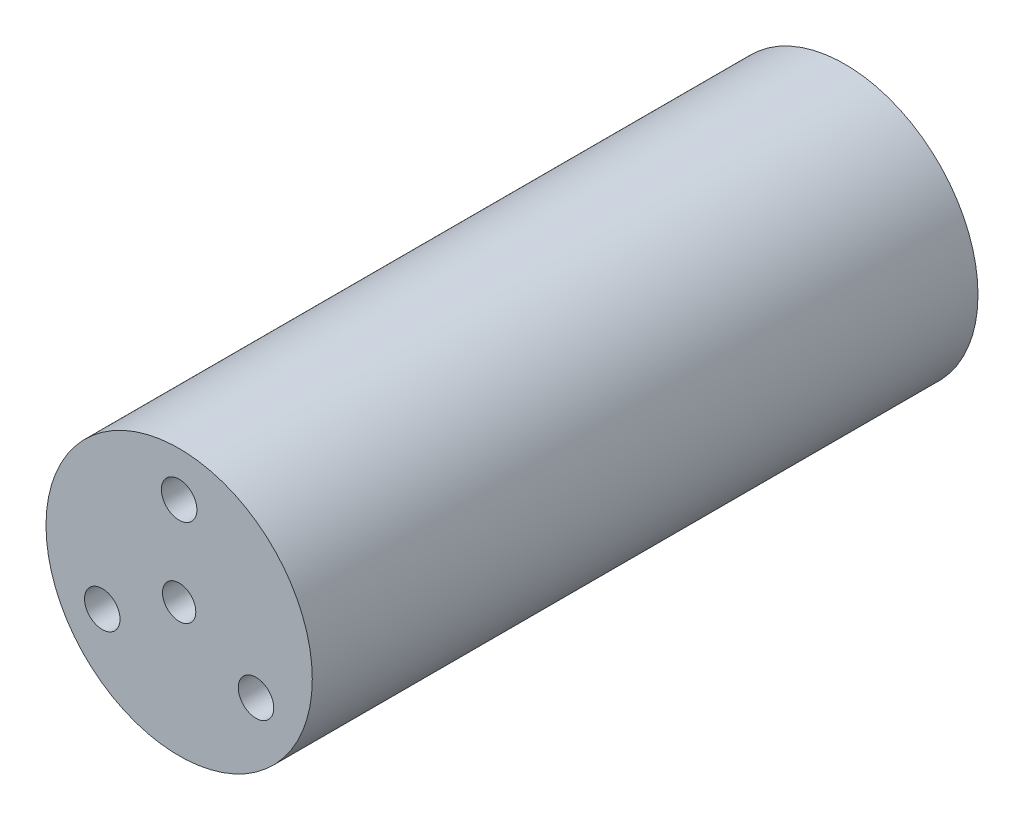
ISO-10303-21;
HEADER;
FILE_DESCRIPTION(('STEP AP214'),'2;1');
FILE_NAME('part.step','',(''),(''),'','','');
FILE_SCHEMA(('AUTOMOTIVE_DESIGN { 1 0 10303 214 1 1 1 1 }'));
ENDSEC;
DATA;
#1=APPLICATION_CONTEXT('core data for automotive mechanical design processes');
#2=APPLICATION_PROTOCOL_DEFINITION('international standard','automotive_design',2000,#1);
#3=PRODUCT_CONTEXT('',#1,'mechanical');
#4=PRODUCT('Part','Part','',(#3));
#5=PRODUCT_RELATED_PRODUCT_CATEGORY('part','',(#4));
#6=PRODUCT_DEFINITION_FORMATION('','',#4);
#7=PRODUCT_DEFINITION_CONTEXT('part definition',#1,'design');
#8=PRODUCT_DEFINITION('design','',#6,#7);
#9=PRODUCT_DEFINITION_SHAPE('','',#8);
#10=(LENGTH_UNIT() NAMED_UNIT(*) SI_UNIT(.MILLI.,.METRE.));
#11=(NAMED_UNIT(*) PLANE_ANGLE_UNIT() SI_UNIT($,.RADIAN.));
#12=(NAMED_UNIT(*) SI_UNIT($,.STERADIAN.) SOLID_ANGLE_UNIT());
#13=UNCERTAINTY_MEASURE_WITH_UNIT(LENGTH_MEASURE(1.E-05),#10,'distance_accuracy_value','');
#14=(GEOMETRIC_REPRESENTATION_CONTEXT(3) GLOBAL_UNCERTAINTY_ASSIGNED_CONTEXT((#13)) GLOBAL_UNIT_ASSIGNED_CONTEXT((#10,
#11,#12)) REPRESENTATION_CONTEXT('',''));
#15=CARTESIAN_POINT('',(0.,0.,0.));
#16=DIRECTION('',(0.,0.,1.));
#17=DIRECTION('',(1.,0.,0.));
#18=AXIS2_PLACEMENT_3D('',#15,#16,#17);
#19=CARTESIAN_POINT('',(0.,0.,30.));
#20=DIRECTION('',(0.,0.,1.));
#21=DIRECTION('',(1.,0.,0.));
#22=AXIS2_PLACEMENT_3D('',#19,#20,#21);
#23=PLANE('',#22);
#24=CARTESIAN_POINT('',(-3.46410161513777,-1.99999999999997,30.));
#25=DIRECTION('',(0.,0.,1.));
#26=DIRECTION('',(1.,0.,0.));
#27=AXIS2_PLACEMENT_3D('',#24,#25,#26);
#28=CIRCLE('',#27,0.799999999999998);
#29=CARTESIAN_POINT('',(-2.66410161513777,-1.99999999999997,30.));
#30=VERTEX_POINT('',#29);
#31=EDGE_CURVE('E62',#30,#30,#28,.T.);
#32=ORIENTED_EDGE('',*,*,#31,.F.);
#33=EDGE_LOOP('',(#32));
#34=FACE_BOUND('',#33,.T.);
#35=CARTESIAN_POINT('',(3.46410161513775,-2.00000000000002,30.));
#36=DIRECTION('',(0.,0.,1.));
#37=DIRECTION('',(1.,0.,0.));
#38=AXIS2_PLACEMENT_3D('',#35,#36,#37);
#39=CIRCLE('',#38,0.799999999999998);
#40=CARTESIAN_POINT('',(4.26410161513774,-2.00000000000002,30.));
#41=VERTEX_POINT('',#40);
#42=EDGE_CURVE('E61',#41,#41,#39,.T.);
#43=ORIENTED_EDGE('',*,*,#42,.F.);
#44=EDGE_LOOP('',(#43));
#45=FACE_BOUND('',#44,.T.);
#46=CARTESIAN_POINT('',(0.,4.,30.));
#47=DIRECTION('',(0.,0.,1.));
#48=DIRECTION('',(1.,0.,0.));
#49=AXIS2_PLACEMENT_3D('',#46,#47,#48);
#50=CIRCLE('',#49,0.799999999999998);
#51=CARTESIAN_POINT('',(0.799999999999998,4.,30.));
#52=VERTEX_POINT('',#51);
#53=EDGE_CURVE('E74',#52,#52,#50,.T.);
#54=ORIENTED_EDGE('',*,*,#53,.F.);
#55=EDGE_LOOP('',(#54));
#56=FACE_BOUND('',#55,.T.);
#57=CARTESIAN_POINT('',(0.,0.,30.));
#58=DIRECTION('',(0.,0.,1.));
#59=DIRECTION('',(1.,0.,0.));
#60=AXIS2_PLACEMENT_3D('',#57,#58,#59);
#61=CIRCLE('',#60,6.);
#62=CARTESIAN_POINT('',(6.,0.,30.));
#63=VERTEX_POINT('',#62);
#64=EDGE_CURVE('E11',#63,#63,#61,.T.);
#65=ORIENTED_EDGE('',*,*,#64,.T.);
#66=EDGE_LOOP('',(#65));
#67=FACE_BOUND('',#66,.T.);
#68=CARTESIAN_POINT('',(0.,0.,30.));
#69=DIRECTION('',(0.,0.,1.));
#70=DIRECTION('',(1.,0.,0.));
#71=AXIS2_PLACEMENT_3D('',#68,#69,#70);
#72=CIRCLE('',#71,0.75);
#73=CARTESIAN_POINT('',(0.75,0.,30.));
#74=VERTEX_POINT('',#73);
#75=EDGE_CURVE('E81',#74,#74,#72,.T.);
#76=ORIENTED_EDGE('',*,*,#75,.F.);
#77=EDGE_LOOP('',(#76));
#78=FACE_BOUND('',#77,.T.);
#79=ADVANCED_FACE('F33',(#34,#45,#56,#67,#78),#23,.T.);
#80=CARTESIAN_POINT('',(0.,0.,0.));
#81=DIRECTION('',(0.,0.,1.));
#82=DIRECTION('',(1.,0.,0.));
#83=AXIS2_PLACEMENT_3D('',#80,#81,#82);
#84=PLANE('',#83);
#85=CARTESIAN_POINT('',(-1.27553556471539,3.79117515068167,0.));
#86=DIRECTION('',(0.,0.,-1.));
#87=DIRECTION('',(1.,0.,0.));
#88=AXIS2_PLACEMENT_3D('',#85,#86,#87);
#89=CIRCLE('',#88,1.);
#90=CARTESIAN_POINT('',(-0.275535564715393,3.79117515068166,0.));
#91=VERTEX_POINT('',#90);
#92=EDGE_CURVE('E159',#91,#91,#89,.T.);
#93=ORIENTED_EDGE('',*,*,#92,.F.);
#94=EDGE_LOOP('',(#93));
#95=FACE_BOUND('',#94,.T.);
#96=CARTESIAN_POINT('',(1.27553556471542,-3.79117515068166,0.));
#97=DIRECTION('',(0.,0.,-1.));
#98=DIRECTION('',(-1.,0.,0.));
#99=AXIS2_PLACEMENT_3D('',#96,#97,#98);
#100=CIRCLE('',#99,1.);
#101=CARTESIAN_POINT('',(0.275535564715419,-3.79117515068166,0.));
#102=VERTEX_POINT('',#101);
#103=EDGE_CURVE('E158',#102,#102,#100,.T.);
#104=ORIENTED_EDGE('',*,*,#103,.F.);
#105=EDGE_LOOP('',(#104));
#106=FACE_BOUND('',#105,.T.);
#107=CARTESIAN_POINT('',(0.,0.,0.));
#108=DIRECTION('',(0.,0.,1.));
#109=DIRECTION('',(1.,0.,0.));
#110=AXIS2_PLACEMENT_3D('',#107,#108,#109);
#111=CIRCLE('',#110,6.);
#112=CARTESIAN_POINT('',(6.,0.,0.));
#113=VERTEX_POINT('',#112);
#114=EDGE_CURVE('E37',#113,#113,#111,.T.);
#115=ORIENTED_EDGE('',*,*,#114,.F.);
#116=EDGE_LOOP('',(#115));
#117=FACE_BOUND('',#116,.T.);
#118=CARTESIAN_POINT('',(0.,0.,0.));
#119=DIRECTION('',(0.,0.,1.));
#120=DIRECTION('',(1.,0.,0.));
#121=AXIS2_PLACEMENT_3D('',#118,#119,#120);
#122=CIRCLE('',#121,0.75);
#123=CARTESIAN_POINT('',(0.75,0.,0.));
#124=VERTEX_POINT('',#123);
#125=EDGE_CURVE('E80',#124,#124,#122,.T.);
#126=ORIENTED_EDGE('',*,*,#125,.T.);
#127=EDGE_LOOP('',(#126));
#128=FACE_BOUND('',#127,.T.);
#129=ADVANCED_FACE('F87',(#95,#106,#117,#128),#84,.F.);
#130=CARTESIAN_POINT('',(0.,0.,30.));
#131=DIRECTION('',(0.,0.,-1.));
#132=DIRECTION('',(-1.,0.,0.));
#133=AXIS2_PLACEMENT_3D('',#130,#131,#132);
#134=CYLINDRICAL_SURFACE('',#133,6.);
#135=ORIENTED_EDGE('',*,*,#64,.F.);
#136=EDGE_LOOP('',(#135));
#137=FACE_BOUND('',#136,.T.);
#138=ORIENTED_EDGE('',*,*,#114,.T.);
#139=EDGE_LOOP('',(#138));
#140=FACE_BOUND('',#139,.T.);
#141=ADVANCED_FACE('F35',(#137,#140),#134,.T.);
#142=CARTESIAN_POINT('',(0.,0.,30.));
#143=DIRECTION('',(0.,0.,-1.));
#144=DIRECTION('',(-1.,0.,0.));
#145=AXIS2_PLACEMENT_3D('',#142,#143,#144);
#146=CYLINDRICAL_SURFACE('',#145,0.75);
#147=ORIENTED_EDGE('',*,*,#75,.T.);
#148=EDGE_LOOP('',(#147));
#149=FACE_BOUND('',#148,.T.);
#150=ORIENTED_EDGE('',*,*,#125,.F.);
#151=EDGE_LOOP('',(#150));
#152=FACE_BOUND('',#151,.T.);
#153=ADVANCED_FACE('F89',(#149,#152),#146,.F.);
#154=CARTESIAN_POINT('',(0.,4.,24.));
#155=DIRECTION('',(0.,0.,1.));
#156=DIRECTION('',(1.,0.,0.));
#157=AXIS2_PLACEMENT_3D('',#154,#155,#156);
#158=CONICAL_SURFACE('',#157,0.799999999999997,1.02974425867665);
#159=CARTESIAN_POINT('',(0.,4.,23.5193115047779));
#160=VERTEX_POINT('',#159);
#161=VERTEX_LOOP('',#160);
#162=FACE_BOUND('',#161,.T.);
#163=CARTESIAN_POINT('',(0.,4.,24.));
#164=DIRECTION('',(0.,0.,1.));
#165=DIRECTION('',(1.,0.,0.));
#166=AXIS2_PLACEMENT_3D('',#163,#164,#165);
#167=CIRCLE('',#166,0.799999999999997);
#168=CARTESIAN_POINT('',(0.799999999999997,4.,24.));
#169=VERTEX_POINT('',#168);
#170=EDGE_CURVE('E77',#169,#169,#167,.T.);
#171=ORIENTED_EDGE('',*,*,#170,.T.);
#172=EDGE_LOOP('',(#171));
#173=FACE_BOUND('',#172,.T.);
#174=ADVANCED_FACE('F91',(#162,#173),#158,.F.);
#175=CARTESIAN_POINT('',(0.,4.,30.));
#176=DIRECTION('',(0.,0.,1.));
#177=DIRECTION('',(1.,0.,0.));
#178=AXIS2_PLACEMENT_3D('',#175,#176,#177);
#179=CYLINDRICAL_SURFACE('',#178,0.799999999999998);
#180=ORIENTED_EDGE('',*,*,#170,.F.);
#181=EDGE_LOOP('',(#180));
#182=FACE_BOUND('',#181,.T.);
#183=ORIENTED_EDGE('',*,*,#53,.T.);
#184=EDGE_LOOP('',(#183));
#185=FACE_BOUND('',#184,.T.);
#186=ADVANCED_FACE('F98',(#182,#185),#179,.F.);
#187=CARTESIAN_POINT('',(3.46410161513775,-2.00000000000002,24.));
#188=DIRECTION('',(0.,0.,1.));
#189=DIRECTION('',(1.,0.,0.));
#190=AXIS2_PLACEMENT_3D('',#187,#188,#189);
#191=CONICAL_SURFACE('',#190,0.799999999999997,1.02974425867665);
#192=CARTESIAN_POINT('',(3.46410161513774,-2.00000000000002,23.5193115047779));
#193=VERTEX_POINT('',#192);
#194=VERTEX_LOOP('',#193);
#195=FACE_BOUND('',#194,.T.);
#196=CARTESIAN_POINT('',(3.46410161513775,-2.00000000000002,24.));
#197=DIRECTION('',(0.,0.,1.));
#198=DIRECTION('',(1.,0.,0.));
#199=AXIS2_PLACEMENT_3D('',#196,#197,#198);
#200=CIRCLE('',#199,0.799999999999997);
#201=CARTESIAN_POINT('',(4.26410161513774,-2.00000000000002,24.));
#202=VERTEX_POINT('',#201);
#203=EDGE_CURVE('E65',#202,#202,#200,.T.);
#204=ORIENTED_EDGE('',*,*,#203,.T.);
#205=EDGE_LOOP('',(#204));
#206=FACE_BOUND('',#205,.T.);
#207=ADVANCED_FACE('F124',(#195,#206),#191,.F.);
#208=CARTESIAN_POINT('',(3.46410161513775,-2.00000000000002,30.));
#209=DIRECTION('',(0.,0.,1.));
#210=DIRECTION('',(1.,0.,0.));
#211=AXIS2_PLACEMENT_3D('',#208,#209,#210);
#212=CYLINDRICAL_SURFACE('',#211,0.799999999999997);
#213=ORIENTED_EDGE('',*,*,#203,.F.);
#214=EDGE_LOOP('',(#213));
#215=FACE_BOUND('',#214,.T.);
#216=ORIENTED_EDGE('',*,*,#42,.T.);
#217=EDGE_LOOP('',(#216));
#218=FACE_BOUND('',#217,.T.);
#219=ADVANCED_FACE('F55',(#215,#218),#212,.F.);
#220=CARTESIAN_POINT('',(-3.46410161513777,-1.99999999999997,24.));
#221=DIRECTION('',(0.,0.,1.));
#222=DIRECTION('',(1.,0.,0.));
#223=AXIS2_PLACEMENT_3D('',#220,#221,#222);
#224=CONICAL_SURFACE('',#223,0.799999999999997,1.02974425867665);
#225=CARTESIAN_POINT('',(-3.46410161513777,-1.99999999999997,23.5193115047779));
#226=VERTEX_POINT('',#225);
#227=VERTEX_LOOP('',#226);
#228=FACE_BOUND('',#227,.T.);
#229=CARTESIAN_POINT('',(-3.46410161513777,-1.99999999999997,24.));
#230=DIRECTION('',(0.,0.,1.));
#231=DIRECTION('',(1.,0.,0.));
#232=AXIS2_PLACEMENT_3D('',#229,#230,#231);
#233=CIRCLE('',#232,0.799999999999997);
#234=CARTESIAN_POINT('',(-2.66410161513778,-1.99999999999997,24.));
#235=VERTEX_POINT('',#234);
#236=EDGE_CURVE('E59',#235,#235,#233,.T.);
#237=ORIENTED_EDGE('',*,*,#236,.T.);
#238=EDGE_LOOP('',(#237));
#239=FACE_BOUND('',#238,.T.);
#240=ADVANCED_FACE('F51',(#228,#239),#224,.F.);
#241=CARTESIAN_POINT('',(-3.46410161513777,-1.99999999999997,30.));
#242=DIRECTION('',(0.,0.,1.));
#243=DIRECTION('',(1.,0.,0.));
#244=AXIS2_PLACEMENT_3D('',#241,#242,#243);
#245=CYLINDRICAL_SURFACE('',#244,0.799999999999997);
#246=ORIENTED_EDGE('',*,*,#236,.F.);
#247=EDGE_LOOP('',(#246));
#248=FACE_BOUND('',#247,.T.);
#249=ORIENTED_EDGE('',*,*,#31,.T.);
#250=EDGE_LOOP('',(#249));
#251=FACE_BOUND('',#250,.T.);
#252=ADVANCED_FACE('F54',(#248,#251),#245,.F.);
#253=CARTESIAN_POINT('',(1.27553556471542,-3.79117515068166,2.));
#254=DIRECTION('',(0.,0.,-1.));
#255=DIRECTION('',(-1.,0.,0.));
#256=AXIS2_PLACEMENT_3D('',#253,#254,#255);
#257=CYLINDRICAL_SURFACE('',#256,1.);
#258=CARTESIAN_POINT('',(1.27553556471542,-3.79117515068166,2.));
#259=DIRECTION('',(0.,0.,-1.));
#260=DIRECTION('',(-1.,0.,0.));
#261=AXIS2_PLACEMENT_3D('',#258,#259,#260);
#262=CIRCLE('',#261,1.);
#263=CARTESIAN_POINT('',(0.275535564715419,-3.79117515068166,2.));
#264=VERTEX_POINT('',#263);
#265=EDGE_CURVE('E68',#264,#264,#262,.T.);
#266=ORIENTED_EDGE('',*,*,#265,.F.);
#267=EDGE_LOOP('',(#266));
#268=FACE_BOUND('',#267,.T.);
#269=ORIENTED_EDGE('',*,*,#103,.T.);
#270=EDGE_LOOP('',(#269));
#271=FACE_BOUND('',#270,.T.);
#272=ADVANCED_FACE('F138',(#268,#271),#257,.F.);
#273=CARTESIAN_POINT('',(1.27553556471542,-3.79117515068166,2.));
#274=DIRECTION('',(0.,0.,-1.));
#275=DIRECTION('',(-1.,0.,0.));
#276=AXIS2_PLACEMENT_3D('',#273,#274,#275);
#277=PLANE('',#276);
#278=ORIENTED_EDGE('',*,*,#265,.T.);
#279=EDGE_LOOP('',(#278));
#280=FACE_BOUND('',#279,.T.);
#281=ADVANCED_FACE('F141',(#280),#277,.T.);
#282=CARTESIAN_POINT('',(-1.27553556471539,3.79117515068167,2.));
#283=DIRECTION('',(0.,0.,-1.));
#284=DIRECTION('',(-1.,0.,0.));
#285=AXIS2_PLACEMENT_3D('',#282,#283,#284);
#286=CYLINDRICAL_SURFACE('',#285,1.);
#287=CARTESIAN_POINT('',(-1.27553556471539,3.79117515068167,2.));
#288=DIRECTION('',(0.,0.,-1.));
#289=DIRECTION('',(1.,0.,0.));
#290=AXIS2_PLACEMENT_3D('',#287,#288,#289);
#291=CIRCLE('',#290,1.);
#292=CARTESIAN_POINT('',(-0.275535564715393,3.79117515068166,2.));
#293=VERTEX_POINT('',#292);
#294=EDGE_CURVE('E157',#293,#293,#291,.T.);
#295=ORIENTED_EDGE('',*,*,#294,.F.);
#296=EDGE_LOOP('',(#295));
#297=FACE_BOUND('',#296,.T.);
#298=ORIENTED_EDGE('',*,*,#92,.T.);
#299=EDGE_LOOP('',(#298));
#300=FACE_BOUND('',#299,.T.);
#301=ADVANCED_FACE('F145',(#297,#300),#286,.F.);
#302=CARTESIAN_POINT('',(-1.27553556471539,3.79117515068167,2.));
#303=DIRECTION('',(0.,0.,-1.));
#304=DIRECTION('',(1.,0.,0.));
#305=AXIS2_PLACEMENT_3D('',#302,#303,#304);
#306=PLANE('',#305);
#307=ORIENTED_EDGE('',*,*,#294,.T.);
#308=EDGE_LOOP('',(#307));
#309=FACE_BOUND('',#308,.T.);
#310=ADVANCED_FACE('F149',(#309),#306,.T.);
#311=CLOSED_SHELL('',(#79,#129,#141,#153,#174,#186,#207,#219,#240,#252,#272,#281,#301,#310));
#312=MANIFOLD_SOLID_BREP('B2',#311);
#313=ADVANCED_BREP_SHAPE_REPRESENTATION('',(#18,#312),#14);
#314=SHAPE_DEFINITION_REPRESENTATION(#9,#313);
ENDSEC;
END-ISO-10303-21;
